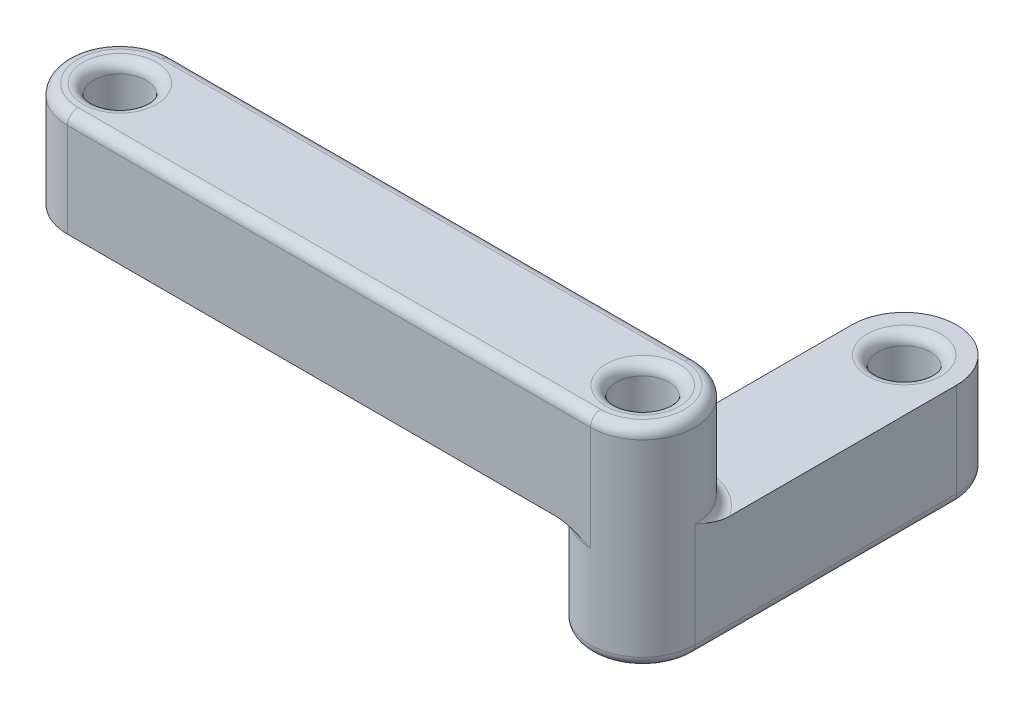
ISO-10303-21;
HEADER;
FILE_DESCRIPTION(('STEP AP214'),'2;1');
FILE_NAME('part.step','',(''),(''),'','','');
FILE_SCHEMA(('AUTOMOTIVE_DESIGN { 1 0 10303 214 1 1 1 1 }'));
ENDSEC;
DATA;
#1=APPLICATION_CONTEXT('core data for automotive mechanical design processes');
#2=APPLICATION_PROTOCOL_DEFINITION('international standard','automotive_design',2000,#1);
#3=PRODUCT_CONTEXT('',#1,'mechanical');
#4=PRODUCT('Part','Part','',(#3));
#5=PRODUCT_RELATED_PRODUCT_CATEGORY('part','',(#4));
#6=PRODUCT_DEFINITION_FORMATION('','',#4);
#7=PRODUCT_DEFINITION_CONTEXT('part definition',#1,'design');
#8=PRODUCT_DEFINITION('design','',#6,#7);
#9=PRODUCT_DEFINITION_SHAPE('','',#8);
#10=(LENGTH_UNIT() NAMED_UNIT(*) SI_UNIT(.MILLI.,.METRE.));
#11=(NAMED_UNIT(*) PLANE_ANGLE_UNIT() SI_UNIT($,.RADIAN.));
#12=(NAMED_UNIT(*) SI_UNIT($,.STERADIAN.) SOLID_ANGLE_UNIT());
#13=UNCERTAINTY_MEASURE_WITH_UNIT(LENGTH_MEASURE(1.E-05),#10,'distance_accuracy_value','');
#14=(GEOMETRIC_REPRESENTATION_CONTEXT(3) GLOBAL_UNCERTAINTY_ASSIGNED_CONTEXT((#13)) GLOBAL_UNIT_ASSIGNED_CONTEXT((#10,
#11,#12)) REPRESENTATION_CONTEXT('',''));
#15=CARTESIAN_POINT('',(0.,0.,0.));
#16=DIRECTION('',(0.,0.,1.));
#17=DIRECTION('',(1.,0.,0.));
#18=AXIS2_PLACEMENT_3D('',#15,#16,#17);
#19=CARTESIAN_POINT('',(0.,10.,0.));
#20=DIRECTION('',(0.,-1.,0.));
#21=DIRECTION('',(0.,0.,-1.));
#22=AXIS2_PLACEMENT_3D('',#19,#20,#21);
#23=CYLINDRICAL_SURFACE('',#22,5.);
#24=DIRECTION('',(0.,-1.,0.));
#25=VECTOR('',#24,1.);
#26=CARTESIAN_POINT('',(0.,10.,5.));
#27=LINE('',#26,#25);
#28=CARTESIAN_POINT('',(0.,-0.999999999999999,5.));
#29=VERTEX_POINT('',#28);
#30=CARTESIAN_POINT('',(0.,-10.,5.));
#31=VERTEX_POINT('',#30);
#32=EDGE_CURVE('E222',#29,#31,#27,.T.);
#33=ORIENTED_EDGE('',*,*,#32,.F.);
#34=CARTESIAN_POINT('',(0.,-0.999999999999999,0.));
#35=DIRECTION('',(0.,-1.,0.));
#36=DIRECTION('',(0.,0.,-1.));
#37=AXIS2_PLACEMENT_3D('',#34,#35,#36);
#38=CIRCLE('',#37,5.);
#39=CARTESIAN_POINT('',(0.,-0.999999999999999,-5.));
#40=VERTEX_POINT('',#39);
#41=EDGE_CURVE('E272',#29,#40,#38,.T.);
#42=ORIENTED_EDGE('',*,*,#41,.T.);
#43=DIRECTION('',(0.,-1.,0.));
#44=VECTOR('',#43,1.);
#45=CARTESIAN_POINT('',(0.,10.,-5.));
#46=LINE('',#45,#44);
#47=CARTESIAN_POINT('',(0.,-10.,-5.));
#48=VERTEX_POINT('',#47);
#49=EDGE_CURVE('E212',#40,#48,#46,.T.);
#50=ORIENTED_EDGE('',*,*,#49,.T.);
#51=CARTESIAN_POINT('',(0.,-10.,0.));
#52=DIRECTION('',(0.,1.,0.));
#53=DIRECTION('',(0.,0.,1.));
#54=AXIS2_PLACEMENT_3D('',#51,#52,#53);
#55=CIRCLE('',#54,5.);
#56=EDGE_CURVE('E201',#48,#31,#55,.T.);
#57=ORIENTED_EDGE('',*,*,#56,.T.);
#58=EDGE_LOOP('',(#33,#42,#50,#57));
#59=FACE_BOUND('',#58,.T.);
#60=ADVANCED_FACE('F40',(#59),#23,.T.);
#61=CARTESIAN_POINT('',(0.,10.,5.));
#62=DIRECTION('',(0.,0.,-1.));
#63=DIRECTION('',(-1.,0.,0.));
#64=AXIS2_PLACEMENT_3D('',#61,#62,#63);
#65=PLANE('',#64);
#66=DIRECTION('',(0.,-1.,0.));
#67=VECTOR('',#66,1.);
#68=CARTESIAN_POINT('',(50.,10.,5.));
#69=LINE('',#68,#67);
#70=CARTESIAN_POINT('',(50.,-0.999999999999999,5.));
#71=VERTEX_POINT('',#70);
#72=CARTESIAN_POINT('',(50.,-11.,5.));
#73=VERTEX_POINT('',#72);
#74=EDGE_CURVE('E64',#71,#73,#69,.T.);
#75=ORIENTED_EDGE('',*,*,#74,.F.);
#76=DIRECTION('',(1.,0.,0.));
#77=VECTOR('',#76,1.);
#78=CARTESIAN_POINT('',(0.,-0.999999999999999,5.));
#79=LINE('',#78,#77);
#80=EDGE_CURVE('E300',#71,#29,#79,.F.);
#81=ORIENTED_EDGE('',*,*,#80,.T.);
#82=ORIENTED_EDGE('',*,*,#32,.T.);
#83=DIRECTION('',(1.,0.,0.));
#84=VECTOR('',#83,1.);
#85=CARTESIAN_POINT('',(0.,-10.,5.));
#86=LINE('',#85,#84);
#87=CARTESIAN_POINT('',(46.6833752096446,-10.,5.));
#88=VERTEX_POINT('',#87);
#89=EDGE_CURVE('E205',#31,#88,#86,.T.);
#90=ORIENTED_EDGE('',*,*,#89,.T.);
#91=CARTESIAN_POINT('',(46.6833752096446,-10.,5.));
#92=CARTESIAN_POINT('',(46.7450551738098,-10.0000073448778,5.));
#93=CARTESIAN_POINT('',(46.8067103718721,-10.0017426295204,5.));
#94=CARTESIAN_POINT('',(46.9298215233883,-10.0083207227693,5.));
#95=CARTESIAN_POINT('',(46.9912775721782,-10.0131617158651,5.));
#96=CARTESIAN_POINT('',(47.1748668693675,-10.0317877579638,5.));
#97=CARTESIAN_POINT('',(47.2965884298721,-10.0496800784524,5.));
#98=CARTESIAN_POINT('',(47.5370271158474,-10.0939613378526,5.));
#99=CARTESIAN_POINT('',(47.6557625493275,-10.1202549836714,5.));
#100=CARTESIAN_POINT('',(47.8915853821564,-10.1796974773276,5.));
#101=CARTESIAN_POINT('',(48.0086713204055,-10.212852039063,5.));
#102=CARTESIAN_POINT('',(48.284488759011,-10.2979248994134,5.));
#103=CARTESIAN_POINT('',(48.4424761581158,-10.3522308971437,5.));
#104=CARTESIAN_POINT('',(48.7558444952943,-10.4679560521697,5.));
#105=CARTESIAN_POINT('',(48.9112243029456,-10.5293782076369,5.));
#106=CARTESIAN_POINT('',(49.3753699632936,-10.7207361591975,5.));
#107=CARTESIAN_POINT('',(49.6812841793298,-10.8574670446341,5.));
#108=CARTESIAN_POINT('',(49.9913933812025,-10.9961510169498,5.));
#109=CARTESIAN_POINT('',(49.9956966961922,-10.9980755182051,5.));
#110=CARTESIAN_POINT('',(50.,-11.,5.));
#111=B_SPLINE_CURVE_WITH_KNOTS('',3,(#91,#92,#93,#94,#95,#96,#97,#98,#99,#100,#101,#102,#103,
#104,#105,#106,#107,#108,#109,#110),.UNSPECIFIED.,.F.,.F.,(4,2,2,2,2,2,2,2,2,4),(0.,
0.184977192336631,0.369846350577189,0.738487583098506,1.1030876409045,1.46799257532018,
1.96890994139299,2.47003912618646,3.47501470229637,3.48915683792113),.UNSPECIFIED.);
#112=EDGE_CURVE('E381',#88,#73,#111,.T.);
#113=ORIENTED_EDGE('',*,*,#112,.T.);
#114=EDGE_LOOP('',(#75,#81,#82,#90,#113));
#115=FACE_BOUND('',#114,.T.);
#116=ADVANCED_FACE('F394',(#115),#65,.F.);
#117=CARTESIAN_POINT('',(50.,10.,0.));
#118=DIRECTION('',(0.,-1.,0.));
#119=DIRECTION('',(0.,0.,-1.));
#120=AXIS2_PLACEMENT_3D('',#117,#118,#119);
#121=CYLINDRICAL_SURFACE('',#120,5.);
#122=ORIENTED_EDGE('',*,*,#74,.T.);
#123=CARTESIAN_POINT('',(50.,-11.,0.));
#124=DIRECTION('',(0.,-1.,0.));
#125=DIRECTION('',(0.,0.,-1.));
#126=AXIS2_PLACEMENT_3D('',#123,#124,#125);
#127=CIRCLE('',#126,5.);
#128=CARTESIAN_POINT('',(45.,-11.,0.));
#129=VERTEX_POINT('',#128);
#130=EDGE_CURVE('E587',#73,#129,#127,.T.);
#131=ORIENTED_EDGE('',*,*,#130,.T.);
#132=DIRECTION('',(0.,1.,0.));
#133=VECTOR('',#132,1.);
#134=CARTESIAN_POINT('',(45.,-20.,0.));
#135=LINE('',#134,#133);
#136=CARTESIAN_POINT('',(45.,-19.,0.));
#137=VERTEX_POINT('',#136);
#138=EDGE_CURVE('E187',#137,#129,#135,.T.);
#139=ORIENTED_EDGE('',*,*,#138,.F.);
#140=CARTESIAN_POINT('',(50.,-19.,0.));
#141=DIRECTION('',(0.,-1.,0.));
#142=DIRECTION('',(0.,0.,-1.));
#143=AXIS2_PLACEMENT_3D('',#140,#141,#142);
#144=CIRCLE('',#143,5.);
#145=CARTESIAN_POINT('',(55.,-19.,0.));
#146=VERTEX_POINT('',#145);
#147=EDGE_CURVE('E261',#137,#146,#144,.F.);
#148=ORIENTED_EDGE('',*,*,#147,.T.);
#149=DIRECTION('',(0.,1.,0.));
#150=VECTOR('',#149,1.);
#151=CARTESIAN_POINT('',(55.,-20.,0.));
#152=LINE('',#151,#150);
#153=CARTESIAN_POINT('',(55.,-9.,0.));
#154=VERTEX_POINT('',#153);
#155=EDGE_CURVE('E177',#146,#154,#152,.T.);
#156=ORIENTED_EDGE('',*,*,#155,.T.);
#157=CARTESIAN_POINT('',(50.,-9.,0.));
#158=DIRECTION('',(0.,-1.,0.));
#159=DIRECTION('',(0.,0.,-1.));
#160=AXIS2_PLACEMENT_3D('',#157,#158,#159);
#161=CIRCLE('',#160,5.);
#162=CARTESIAN_POINT('',(50.,-9.,-5.));
#163=VERTEX_POINT('',#162);
#164=EDGE_CURVE('E307',#154,#163,#161,.F.);
#165=ORIENTED_EDGE('',*,*,#164,.T.);
#166=DIRECTION('',(0.,-1.,0.));
#167=VECTOR('',#166,1.);
#168=CARTESIAN_POINT('',(50.,10.,-5.));
#169=LINE('',#168,#167);
#170=CARTESIAN_POINT('',(50.,-0.999999999999999,-5.));
#171=VERTEX_POINT('',#170);
#172=EDGE_CURVE('E216',#171,#163,#169,.T.);
#173=ORIENTED_EDGE('',*,*,#172,.F.);
#174=CARTESIAN_POINT('',(50.,-0.999999999999999,0.));
#175=DIRECTION('',(0.,-1.,0.));
#176=DIRECTION('',(0.,0.,-1.));
#177=AXIS2_PLACEMENT_3D('',#174,#175,#176);
#178=CIRCLE('',#177,5.);
#179=EDGE_CURVE('E258',#171,#71,#178,.T.);
#180=ORIENTED_EDGE('',*,*,#179,.T.);
#181=EDGE_LOOP('',(#122,#131,#139,#148,#156,#165,#173,#180));
#182=FACE_BOUND('',#181,.T.);
#183=ADVANCED_FACE('F399',(#182),#121,.T.);
#184=CARTESIAN_POINT('',(0.,10.,-5.));
#185=DIRECTION('',(0.,0.,1.));
#186=DIRECTION('',(1.,0.,0.));
#187=AXIS2_PLACEMENT_3D('',#184,#185,#186);
#188=PLANE('',#187);
#189=ORIENTED_EDGE('',*,*,#172,.T.);
#190=DIRECTION('',(-1.,0.,0.));
#191=VECTOR('',#190,1.);
#192=CARTESIAN_POINT('',(45.,-9.,-5.));
#193=LINE('',#192,#191);
#194=CARTESIAN_POINT('',(45.,-9.,-5.));
#195=VERTEX_POINT('',#194);
#196=EDGE_CURVE('E346',#163,#195,#193,.T.);
#197=ORIENTED_EDGE('',*,*,#196,.T.);
#198=DIRECTION('',(0.,-1.,0.));
#199=VECTOR('',#198,1.);
#200=CARTESIAN_POINT('',(45.,-20.,-5.));
#201=LINE('',#200,#199);
#202=CARTESIAN_POINT('',(45.,-11.,-5.));
#203=VERTEX_POINT('',#202);
#204=EDGE_CURVE('E56',#195,#203,#201,.T.);
#205=ORIENTED_EDGE('',*,*,#204,.T.);
#206=CARTESIAN_POINT('',(44.,-11.,-5.));
#207=DIRECTION('',(0.,0.,1.));
#208=DIRECTION('',(1.,0.,0.));
#209=AXIS2_PLACEMENT_3D('',#206,#207,#208);
#210=CIRCLE('',#209,1.);
#211=CARTESIAN_POINT('',(44.,-10.,-5.));
#212=VERTEX_POINT('',#211);
#213=EDGE_CURVE('E390',#203,#212,#210,.T.);
#214=ORIENTED_EDGE('',*,*,#213,.T.);
#215=DIRECTION('',(-1.,0.,0.));
#216=VECTOR('',#215,1.);
#217=CARTESIAN_POINT('',(0.,-10.,-5.));
#218=LINE('',#217,#216);
#219=EDGE_CURVE('E209',#212,#48,#218,.T.);
#220=ORIENTED_EDGE('',*,*,#219,.T.);
#221=ORIENTED_EDGE('',*,*,#49,.F.);
#222=DIRECTION('',(1.,0.,0.));
#223=VECTOR('',#222,1.);
#224=CARTESIAN_POINT('',(0.,-0.999999999999999,-5.));
#225=LINE('',#224,#223);
#226=EDGE_CURVE('E297',#40,#171,#225,.T.);
#227=ORIENTED_EDGE('',*,*,#226,.T.);
#228=EDGE_LOOP('',(#189,#197,#205,#214,#220,#221,#227));
#229=FACE_BOUND('',#228,.T.);
#230=ADVANCED_FACE('F515',(#229),#188,.F.);
#231=CARTESIAN_POINT('',(0.,10.,0.));
#232=DIRECTION('',(0.,-1.,0.));
#233=DIRECTION('',(0.,0.,-1.));
#234=AXIS2_PLACEMENT_3D('',#231,#232,#233);
#235=CYLINDRICAL_SURFACE('',#234,2.5);
#236=CARTESIAN_POINT('',(0.,-0.999999999999999,0.));
#237=DIRECTION('',(0.,-1.,0.));
#238=DIRECTION('',(0.,0.,-1.));
#239=AXIS2_PLACEMENT_3D('',#236,#237,#238);
#240=CIRCLE('',#239,2.5);
#241=CARTESIAN_POINT('',(0.,-0.999999999999999,-2.5));
#242=VERTEX_POINT('',#241);
#243=EDGE_CURVE('E303',#242,#242,#240,.F.);
#244=ORIENTED_EDGE('',*,*,#243,.T.);
#245=EDGE_LOOP('',(#244));
#246=FACE_BOUND('',#245,.T.);
#247=CARTESIAN_POINT('',(0.,-10.,0.));
#248=DIRECTION('',(0.,1.,0.));
#249=DIRECTION('',(0.,0.,1.));
#250=AXIS2_PLACEMENT_3D('',#247,#248,#249);
#251=CIRCLE('',#250,2.5);
#252=CARTESIAN_POINT('',(0.,-10.,2.5));
#253=VERTEX_POINT('',#252);
#254=EDGE_CURVE('E197',#253,#253,#251,.T.);
#255=ORIENTED_EDGE('',*,*,#254,.F.);
#256=EDGE_LOOP('',(#255));
#257=FACE_BOUND('',#256,.T.);
#258=ADVANCED_FACE('F521',(#246,#257),#235,.F.);
#259=CARTESIAN_POINT('',(50.,10.,0.));
#260=DIRECTION('',(0.,-1.,0.));
#261=DIRECTION('',(0.,0.,-1.));
#262=AXIS2_PLACEMENT_3D('',#259,#260,#261);
#263=CYLINDRICAL_SURFACE('',#262,2.5);
#264=CARTESIAN_POINT('',(50.,-19.,0.));
#265=DIRECTION('',(0.,-1.,0.));
#266=DIRECTION('',(0.,0.,-1.));
#267=AXIS2_PLACEMENT_3D('',#264,#265,#266);
#268=CIRCLE('',#267,2.5);
#269=CARTESIAN_POINT('',(50.,-19.,-2.5));
#270=VERTEX_POINT('',#269);
#271=EDGE_CURVE('E268',#270,#270,#268,.T.);
#272=ORIENTED_EDGE('',*,*,#271,.T.);
#273=EDGE_LOOP('',(#272));
#274=FACE_BOUND('',#273,.T.);
#275=CARTESIAN_POINT('',(50.,-0.999999999999999,0.));
#276=DIRECTION('',(0.,-1.,0.));
#277=DIRECTION('',(0.,0.,-1.));
#278=AXIS2_PLACEMENT_3D('',#275,#276,#277);
#279=CIRCLE('',#278,2.5);
#280=CARTESIAN_POINT('',(50.,-0.999999999999999,-2.5));
#281=VERTEX_POINT('',#280);
#282=EDGE_CURVE('E264',#281,#281,#279,.F.);
#283=ORIENTED_EDGE('',*,*,#282,.T.);
#284=EDGE_LOOP('',(#283));
#285=FACE_BOUND('',#284,.T.);
#286=ADVANCED_FACE('F528',(#274,#285),#263,.F.);
#287=CARTESIAN_POINT('',(0.,-10.,0.));
#288=DIRECTION('',(0.,-1.,0.));
#289=DIRECTION('',(0.,0.,1.));
#290=AXIS2_PLACEMENT_3D('',#287,#288,#289);
#291=PLANE('',#290);
#292=DIRECTION('',(0.,0.,1.));
#293=VECTOR('',#292,1.);
#294=CARTESIAN_POINT('',(44.,-10.,0.));
#295=LINE('',#294,#293);
#296=CARTESIAN_POINT('',(44.,-10.,0.));
#297=VERTEX_POINT('',#296);
#298=EDGE_CURVE('E581',#212,#297,#295,.T.);
#299=ORIENTED_EDGE('',*,*,#298,.T.);
#300=CARTESIAN_POINT('',(50.,-10.,0.));
#301=DIRECTION('',(0.,-1.,0.));
#302=DIRECTION('',(0.,0.,-1.));
#303=AXIS2_PLACEMENT_3D('',#300,#301,#302);
#304=CIRCLE('',#303,6.);
#305=EDGE_CURVE('E584',#297,#88,#304,.F.);
#306=ORIENTED_EDGE('',*,*,#305,.T.);
#307=ORIENTED_EDGE('',*,*,#89,.F.);
#308=ORIENTED_EDGE('',*,*,#56,.F.);
#309=ORIENTED_EDGE('',*,*,#219,.F.);
#310=EDGE_LOOP('',(#299,#306,#307,#308,#309));
#311=FACE_BOUND('',#310,.T.);
#312=ORIENTED_EDGE('',*,*,#254,.T.);
#313=EDGE_LOOP('',(#312));
#314=FACE_BOUND('',#313,.T.);
#315=ADVANCED_FACE('F477',(#311,#314),#291,.T.);
#316=CARTESIAN_POINT('',(50.,-10.,0.));
#317=DIRECTION('',(0.,-1.,0.));
#318=DIRECTION('',(0.,0.,1.));
#319=AXIS2_PLACEMENT_3D('',#316,#317,#318);
#320=PLANE('',#319);
#321=CARTESIAN_POINT('',(50.,-10.,-25.));
#322=DIRECTION('',(0.,-1.,0.));
#323=DIRECTION('',(0.,0.,-1.));
#324=AXIS2_PLACEMENT_3D('',#321,#322,#323);
#325=CIRCLE('',#324,3.5);
#326=CARTESIAN_POINT('',(50.,-10.,-28.5));
#327=VERTEX_POINT('',#326);
#328=EDGE_CURVE('E11',#327,#327,#325,.T.);
#329=ORIENTED_EDGE('',*,*,#328,.T.);
#330=EDGE_LOOP('',(#329));
#331=FACE_BOUND('',#330,.T.);
#332=DIRECTION('',(-1.,0.,0.));
#333=VECTOR('',#332,1.);
#334=CARTESIAN_POINT('',(50.,-10.,-6.));
#335=LINE('',#334,#333);
#336=CARTESIAN_POINT('',(45.,-10.,-6.));
#337=VERTEX_POINT('',#336);
#338=CARTESIAN_POINT('',(50.,-10.,-6.));
#339=VERTEX_POINT('',#338);
#340=EDGE_CURVE('E339',#337,#339,#335,.F.);
#341=ORIENTED_EDGE('',*,*,#340,.T.);
#342=CARTESIAN_POINT('',(50.,-10.,0.));
#343=DIRECTION('',(0.,-1.,0.));
#344=DIRECTION('',(0.,0.,-1.));
#345=AXIS2_PLACEMENT_3D('',#342,#343,#344);
#346=CIRCLE('',#345,6.);
#347=CARTESIAN_POINT('',(55.,-10.,-3.3166247903554));
#348=VERTEX_POINT('',#347);
#349=EDGE_CURVE('E161',#339,#348,#346,.T.);
#350=ORIENTED_EDGE('',*,*,#349,.T.);
#351=DIRECTION('',(0.,0.,-1.));
#352=VECTOR('',#351,1.);
#353=CARTESIAN_POINT('',(55.,-10.,0.));
#354=LINE('',#353,#352);
#355=CARTESIAN_POINT('',(55.,-10.,-25.));
#356=VERTEX_POINT('',#355);
#357=EDGE_CURVE('E154',#348,#356,#354,.T.);
#358=ORIENTED_EDGE('',*,*,#357,.T.);
#359=CARTESIAN_POINT('',(50.,-10.,-25.));
#360=DIRECTION('',(0.,1.,0.));
#361=DIRECTION('',(0.,0.,1.));
#362=AXIS2_PLACEMENT_3D('',#359,#360,#361);
#363=CIRCLE('',#362,5.);
#364=CARTESIAN_POINT('',(45.,-10.,-25.));
#365=VERTEX_POINT('',#364);
#366=EDGE_CURVE('E159',#356,#365,#363,.T.);
#367=ORIENTED_EDGE('',*,*,#366,.T.);
#368=DIRECTION('',(0.,0.,1.));
#369=VECTOR('',#368,1.);
#370=CARTESIAN_POINT('',(45.,-10.,0.));
#371=LINE('',#370,#369);
#372=EDGE_CURVE('E184',#365,#337,#371,.T.);
#373=ORIENTED_EDGE('',*,*,#372,.T.);
#374=EDGE_LOOP('',(#341,#350,#358,#367,#373));
#375=FACE_BOUND('',#374,.T.);
#376=ADVANCED_FACE('F156',(#331,#375),#320,.F.);
#377=CARTESIAN_POINT('',(50.,-20.,0.));
#378=DIRECTION('',(0.,-1.,0.));
#379=DIRECTION('',(0.,0.,1.));
#380=AXIS2_PLACEMENT_3D('',#377,#378,#379);
#381=PLANE('',#380);
#382=CARTESIAN_POINT('',(50.,-20.,-25.));
#383=DIRECTION('',(0.,-1.,0.));
#384=DIRECTION('',(0.,0.,-1.));
#385=AXIS2_PLACEMENT_3D('',#382,#383,#384);
#386=CIRCLE('',#385,3.5);
#387=CARTESIAN_POINT('',(50.,-20.,-28.5));
#388=VERTEX_POINT('',#387);
#389=EDGE_CURVE('E242',#388,#388,#386,.F.);
#390=ORIENTED_EDGE('',*,*,#389,.T.);
#391=EDGE_LOOP('',(#390));
#392=FACE_BOUND('',#391,.T.);
#393=CARTESIAN_POINT('',(50.,-20.,-25.));
#394=DIRECTION('',(0.,-1.,0.));
#395=DIRECTION('',(0.,0.,-1.));
#396=AXIS2_PLACEMENT_3D('',#393,#394,#395);
#397=CIRCLE('',#396,4.);
#398=CARTESIAN_POINT('',(46.,-20.,-25.));
#399=VERTEX_POINT('',#398);
#400=CARTESIAN_POINT('',(54.,-20.,-25.));
#401=VERTEX_POINT('',#400);
#402=EDGE_CURVE('E235',#399,#401,#397,.T.);
#403=ORIENTED_EDGE('',*,*,#402,.T.);
#404=DIRECTION('',(0.,0.,-1.));
#405=VECTOR('',#404,1.);
#406=CARTESIAN_POINT('',(54.,-20.,0.));
#407=LINE('',#406,#405);
#408=CARTESIAN_POINT('',(54.,-20.,0.));
#409=VERTEX_POINT('',#408);
#410=EDGE_CURVE('E238',#401,#409,#407,.F.);
#411=ORIENTED_EDGE('',*,*,#410,.T.);
#412=CARTESIAN_POINT('',(50.,-20.,0.));
#413=DIRECTION('',(0.,-1.,0.));
#414=DIRECTION('',(0.,0.,-1.));
#415=AXIS2_PLACEMENT_3D('',#412,#413,#414);
#416=CIRCLE('',#415,4.);
#417=CARTESIAN_POINT('',(46.,-20.,0.));
#418=VERTEX_POINT('',#417);
#419=EDGE_CURVE('E229',#409,#418,#416,.T.);
#420=ORIENTED_EDGE('',*,*,#419,.T.);
#421=DIRECTION('',(0.,0.,1.));
#422=VECTOR('',#421,1.);
#423=CARTESIAN_POINT('',(46.,-20.,-25.));
#424=LINE('',#423,#422);
#425=EDGE_CURVE('E232',#418,#399,#424,.F.);
#426=ORIENTED_EDGE('',*,*,#425,.T.);
#427=EDGE_LOOP('',(#403,#411,#420,#426));
#428=FACE_BOUND('',#427,.T.);
#429=CARTESIAN_POINT('',(50.,-20.,0.));
#430=DIRECTION('',(0.,-1.,0.));
#431=DIRECTION('',(0.,0.,-1.));
#432=AXIS2_PLACEMENT_3D('',#429,#430,#431);
#433=CIRCLE('',#432,3.5);
#434=CARTESIAN_POINT('',(50.,-20.,-3.5));
#435=VERTEX_POINT('',#434);
#436=EDGE_CURVE('E225',#435,#435,#433,.F.);
#437=ORIENTED_EDGE('',*,*,#436,.T.);
#438=EDGE_LOOP('',(#437));
#439=FACE_BOUND('',#438,.T.);
#440=ADVANCED_FACE('F471',(#392,#428,#439),#381,.T.);
#441=CARTESIAN_POINT('',(55.,-20.,0.));
#442=DIRECTION('',(-1.,0.,0.));
#443=DIRECTION('',(0.,0.,1.));
#444=AXIS2_PLACEMENT_3D('',#441,#442,#443);
#445=PLANE('',#444);
#446=ORIENTED_EDGE('',*,*,#155,.F.);
#447=DIRECTION('',(0.,0.,-1.));
#448=VECTOR('',#447,1.);
#449=CARTESIAN_POINT('',(55.,-19.,-25.));
#450=LINE('',#449,#448);
#451=CARTESIAN_POINT('',(55.,-19.,-25.));
#452=VERTEX_POINT('',#451);
#453=EDGE_CURVE('E174',#146,#452,#450,.T.);
#454=ORIENTED_EDGE('',*,*,#453,.T.);
#455=DIRECTION('',(0.,1.,0.));
#456=VECTOR('',#455,1.);
#457=CARTESIAN_POINT('',(55.,-20.,-25.));
#458=LINE('',#457,#456);
#459=EDGE_CURVE('E170',#452,#356,#458,.T.);
#460=ORIENTED_EDGE('',*,*,#459,.T.);
#461=ORIENTED_EDGE('',*,*,#357,.F.);
#462=CARTESIAN_POINT('',(55.,-10.,-3.3166247903554));
#463=CARTESIAN_POINT('',(55.,-9.99999265512221,-3.25494482619008));
#464=CARTESIAN_POINT('',(55.,-9.99825737047963,-3.19328962812761));
#465=CARTESIAN_POINT('',(55.,-9.99167927723069,-3.07017847661111));
#466=CARTESIAN_POINT('',(55.,-9.9868382841348,-3.00872242782101));
#467=CARTESIAN_POINT('',(55.,-9.96821224203602,-2.82513313063131));
#468=CARTESIAN_POINT('',(55.,-9.95031992154743,-2.70341157012645));
#469=CARTESIAN_POINT('',(55.,-9.90603866214711,-2.46297288415124));
#470=CARTESIAN_POINT('',(55.,-9.87974501632837,-2.34423745067143));
#471=CARTESIAN_POINT('',(55.,-9.82030252267229,-2.10841461784311));
#472=CARTESIAN_POINT('',(55.,-9.78714796093694,-1.99132867959425));
#473=CARTESIAN_POINT('',(55.,-9.70207510058658,-1.71551124098912));
#474=CARTESIAN_POINT('',(55.,-9.64776910285604,-1.55752384188437));
#475=CARTESIAN_POINT('',(55.,-9.53204394783059,-1.24415550470578));
#476=CARTESIAN_POINT('',(55.,-9.47062179236419,-1.08877569705426));
#477=CARTESIAN_POINT('',(55.,-9.27926384080067,-0.624630036707562));
#478=CARTESIAN_POINT('',(55.,-9.14253295535513,-0.318715820675118));
#479=CARTESIAN_POINT('',(55.,-9.00384898304987,-0.00860661879758961));
#480=CARTESIAN_POINT('',(55.,-9.00192448179476,-0.00430330380789881));
#481=CARTESIAN_POINT('',(55.,-9.,0.));
#482=B_SPLINE_CURVE_WITH_KNOTS('',3,(#462,#463,#464,#465,#466,#467,#468,#469,#470,#471,#472,
#473,#474,#475,#476,#477,#478,#479,#480,#481),.UNSPECIFIED.,.F.,.F.,(4,2,2,2,2,2,2,2,2,4),(0.,
0.18497719233711,0.369846350578148,0.738487583100217,1.1030876409053,1.46799257532017,
1.96890994139287,2.47003912618606,3.47501470229638,3.48915683792113),.UNSPECIFIED.);
#483=EDGE_CURVE('E349',#348,#154,#482,.T.);
#484=ORIENTED_EDGE('',*,*,#483,.T.);
#485=EDGE_LOOP('',(#446,#454,#460,#461,#484));
#486=FACE_BOUND('',#485,.T.);
#487=ADVANCED_FACE('F172',(#486),#445,.F.);
#488=CARTESIAN_POINT('',(50.,-20.,-25.));
#489=DIRECTION('',(0.,1.,0.));
#490=DIRECTION('',(0.,0.,-1.));
#491=AXIS2_PLACEMENT_3D('',#488,#489,#490);
#492=CYLINDRICAL_SURFACE('',#491,5.);
#493=ORIENTED_EDGE('',*,*,#459,.F.);
#494=CARTESIAN_POINT('',(50.,-19.,-25.));
#495=DIRECTION('',(0.,-1.,0.));
#496=DIRECTION('',(0.,0.,-1.));
#497=AXIS2_PLACEMENT_3D('',#494,#495,#496);
#498=CIRCLE('',#497,5.);
#499=CARTESIAN_POINT('',(45.,-19.,-25.));
#500=VERTEX_POINT('',#499);
#501=EDGE_CURVE('E252',#452,#500,#498,.F.);
#502=ORIENTED_EDGE('',*,*,#501,.T.);
#503=DIRECTION('',(0.,1.,0.));
#504=VECTOR('',#503,1.);
#505=CARTESIAN_POINT('',(45.,-20.,-25.));
#506=LINE('',#505,#504);
#507=EDGE_CURVE('E178',#500,#365,#506,.T.);
#508=ORIENTED_EDGE('',*,*,#507,.T.);
#509=ORIENTED_EDGE('',*,*,#366,.F.);
#510=EDGE_LOOP('',(#493,#502,#508,#509));
#511=FACE_BOUND('',#510,.T.);
#512=ADVANCED_FACE('F180',(#511),#492,.T.);
#513=CARTESIAN_POINT('',(45.,-20.,0.));
#514=DIRECTION('',(1.,0.,0.));
#515=DIRECTION('',(0.,0.,-1.));
#516=AXIS2_PLACEMENT_3D('',#513,#514,#515);
#517=PLANE('',#516);
#518=ORIENTED_EDGE('',*,*,#138,.T.);
#519=DIRECTION('',(0.,0.,1.));
#520=VECTOR('',#519,1.);
#521=CARTESIAN_POINT('',(45.,-11.,0.));
#522=LINE('',#521,#520);
#523=EDGE_CURVE('E391',#129,#203,#522,.F.);
#524=ORIENTED_EDGE('',*,*,#523,.T.);
#525=ORIENTED_EDGE('',*,*,#204,.F.);
#526=CARTESIAN_POINT('',(45.,-9.,-6.));
#527=DIRECTION('',(1.,0.,0.));
#528=DIRECTION('',(0.,0.,-1.));
#529=AXIS2_PLACEMENT_3D('',#526,#527,#528);
#530=CIRCLE('',#529,1.);
#531=EDGE_CURVE('E358',#195,#337,#530,.T.);
#532=ORIENTED_EDGE('',*,*,#531,.T.);
#533=ORIENTED_EDGE('',*,*,#372,.F.);
#534=ORIENTED_EDGE('',*,*,#507,.F.);
#535=DIRECTION('',(0.,0.,1.));
#536=VECTOR('',#535,1.);
#537=CARTESIAN_POINT('',(45.,-19.,0.));
#538=LINE('',#537,#536);
#539=EDGE_CURVE('E255',#500,#137,#538,.T.);
#540=ORIENTED_EDGE('',*,*,#539,.T.);
#541=EDGE_LOOP('',(#518,#524,#525,#532,#533,#534,#540));
#542=FACE_BOUND('',#541,.T.);
#543=ADVANCED_FACE('F467',(#542),#517,.F.);
#544=CARTESIAN_POINT('',(50.,-20.,-25.));
#545=DIRECTION('',(0.,1.,0.));
#546=DIRECTION('',(0.,0.,-1.));
#547=AXIS2_PLACEMENT_3D('',#544,#545,#546);
#548=CYLINDRICAL_SURFACE('',#547,2.5);
#549=CARTESIAN_POINT('',(50.,-11.,-25.));
#550=DIRECTION('',(0.,-1.,0.));
#551=DIRECTION('',(0.,0.,-1.));
#552=AXIS2_PLACEMENT_3D('',#549,#550,#551);
#553=CIRCLE('',#552,2.5);
#554=CARTESIAN_POINT('',(50.,-11.,-27.5));
#555=VERTEX_POINT('',#554);
#556=EDGE_CURVE('E49',#555,#555,#553,.F.);
#557=ORIENTED_EDGE('',*,*,#556,.T.);
#558=EDGE_LOOP('',(#557));
#559=FACE_BOUND('',#558,.T.);
#560=CARTESIAN_POINT('',(50.,-19.,-25.));
#561=DIRECTION('',(0.,-1.,0.));
#562=DIRECTION('',(0.,0.,-1.));
#563=AXIS2_PLACEMENT_3D('',#560,#561,#562);
#564=CIRCLE('',#563,2.5);
#565=CARTESIAN_POINT('',(50.,-19.,-27.5));
#566=VERTEX_POINT('',#565);
#567=EDGE_CURVE('E246',#566,#566,#564,.T.);
#568=ORIENTED_EDGE('',*,*,#567,.T.);
#569=EDGE_LOOP('',(#568));
#570=FACE_BOUND('',#569,.T.);
#571=ADVANCED_FACE('F458',(#559,#570),#548,.F.);
#572=CARTESIAN_POINT('',(-5.,0.,5.));
#573=DIRECTION('',(0.,-1.,0.));
#574=DIRECTION('',(0.,0.,-1.));
#575=AXIS2_PLACEMENT_3D('',#572,#573,#574);
#576=PLANE('',#575);
#577=DIRECTION('',(1.,0.,0.));
#578=VECTOR('',#577,1.);
#579=CARTESIAN_POINT('',(-5.,0.,-4.));
#580=LINE('',#579,#578);
#581=CARTESIAN_POINT('',(50.,0.,-4.));
#582=VERTEX_POINT('',#581);
#583=CARTESIAN_POINT('',(0.,0.,-4.));
#584=VERTEX_POINT('',#583);
#585=EDGE_CURVE('E290',#582,#584,#580,.F.);
#586=ORIENTED_EDGE('',*,*,#585,.T.);
#587=CARTESIAN_POINT('',(0.,0.,0.));
#588=DIRECTION('',(0.,-1.,0.));
#589=DIRECTION('',(0.,0.,-1.));
#590=AXIS2_PLACEMENT_3D('',#587,#588,#589);
#591=CIRCLE('',#590,4.);
#592=CARTESIAN_POINT('',(0.,0.,4.));
#593=VERTEX_POINT('',#592);
#594=EDGE_CURVE('E293',#584,#593,#591,.F.);
#595=ORIENTED_EDGE('',*,*,#594,.T.);
#596=DIRECTION('',(1.,0.,0.));
#597=VECTOR('',#596,1.);
#598=CARTESIAN_POINT('',(-5.,0.,4.));
#599=LINE('',#598,#597);
#600=CARTESIAN_POINT('',(50.,0.,4.));
#601=VERTEX_POINT('',#600);
#602=EDGE_CURVE('E284',#593,#601,#599,.T.);
#603=ORIENTED_EDGE('',*,*,#602,.T.);
#604=CARTESIAN_POINT('',(50.,0.,0.));
#605=DIRECTION('',(0.,-1.,0.));
#606=DIRECTION('',(0.,0.,-1.));
#607=AXIS2_PLACEMENT_3D('',#604,#605,#606);
#608=CIRCLE('',#607,4.);
#609=EDGE_CURVE('E287',#601,#582,#608,.F.);
#610=ORIENTED_EDGE('',*,*,#609,.T.);
#611=EDGE_LOOP('',(#586,#595,#603,#610));
#612=FACE_BOUND('',#611,.T.);
#613=CARTESIAN_POINT('',(50.,0.,0.));
#614=DIRECTION('',(0.,-1.,0.));
#615=DIRECTION('',(0.,0.,-1.));
#616=AXIS2_PLACEMENT_3D('',#613,#614,#615);
#617=CIRCLE('',#616,3.5);
#618=CARTESIAN_POINT('',(50.,0.,-3.5));
#619=VERTEX_POINT('',#618);
#620=EDGE_CURVE('E280',#619,#619,#617,.T.);
#621=ORIENTED_EDGE('',*,*,#620,.T.);
#622=EDGE_LOOP('',(#621));
#623=FACE_BOUND('',#622,.T.);
#624=CARTESIAN_POINT('',(0.,0.,0.));
#625=DIRECTION('',(0.,-1.,0.));
#626=DIRECTION('',(0.,0.,-1.));
#627=AXIS2_PLACEMENT_3D('',#624,#625,#626);
#628=CIRCLE('',#627,3.5);
#629=CARTESIAN_POINT('',(0.,0.,-3.5));
#630=VERTEX_POINT('',#629);
#631=EDGE_CURVE('E276',#630,#630,#628,.T.);
#632=ORIENTED_EDGE('',*,*,#631,.T.);
#633=EDGE_LOOP('',(#632));
#634=FACE_BOUND('',#633,.T.);
#635=ADVANCED_FACE('F409',(#612,#623,#634),#576,.F.);
#636=CARTESIAN_POINT('',(50.,-19.,-25.));
#637=DIRECTION('',(0.,-1.,0.));
#638=DIRECTION('',(0.,0.,-1.));
#639=AXIS2_PLACEMENT_3D('',#636,#637,#638);
#640=TOROIDAL_SURFACE('',#639,3.5,1.);
#641=ORIENTED_EDGE('',*,*,#567,.F.);
#642=EDGE_LOOP('',(#641));
#643=FACE_BOUND('',#642,.T.);
#644=ORIENTED_EDGE('',*,*,#389,.F.);
#645=EDGE_LOOP('',(#644));
#646=FACE_BOUND('',#645,.T.);
#647=ADVANCED_FACE('F405',(#643,#646),#640,.T.);
#648=CARTESIAN_POINT('',(46.,-19.,0.));
#649=DIRECTION('',(0.,0.,-1.));
#650=DIRECTION('',(-1.,0.,0.));
#651=AXIS2_PLACEMENT_3D('',#648,#649,#650);
#652=CYLINDRICAL_SURFACE('',#651,1.);
#653=CARTESIAN_POINT('',(46.,-19.,-25.));
#654=DIRECTION('',(0.,0.,-1.));
#655=DIRECTION('',(-1.,0.,0.));
#656=AXIS2_PLACEMENT_3D('',#653,#654,#655);
#657=CIRCLE('',#656,1.);
#658=EDGE_CURVE('E315',#399,#500,#657,.T.);
#659=ORIENTED_EDGE('',*,*,#658,.F.);
#660=ORIENTED_EDGE('',*,*,#425,.F.);
#661=CARTESIAN_POINT('',(46.,-19.,0.));
#662=DIRECTION('',(0.,0.,1.));
#663=DIRECTION('',(1.,0.,0.));
#664=AXIS2_PLACEMENT_3D('',#661,#662,#663);
#665=CIRCLE('',#664,1.);
#666=EDGE_CURVE('E166',#137,#418,#665,.T.);
#667=ORIENTED_EDGE('',*,*,#666,.F.);
#668=ORIENTED_EDGE('',*,*,#539,.F.);
#669=EDGE_LOOP('',(#659,#660,#667,#668));
#670=FACE_BOUND('',#669,.T.);
#671=ADVANCED_FACE('F408',(#670),#652,.T.);
#672=CARTESIAN_POINT('',(50.,-19.,0.));
#673=DIRECTION('',(0.,-1.,0.));
#674=DIRECTION('',(0.,0.,-1.));
#675=AXIS2_PLACEMENT_3D('',#672,#673,#674);
#676=TOROIDAL_SURFACE('',#675,4.,1.);
#677=ORIENTED_EDGE('',*,*,#666,.T.);
#678=ORIENTED_EDGE('',*,*,#419,.F.);
#679=CARTESIAN_POINT('',(54.,-19.,0.));
#680=DIRECTION('',(0.,0.,-1.));
#681=DIRECTION('',(-1.,0.,0.));
#682=AXIS2_PLACEMENT_3D('',#679,#680,#681);
#683=CIRCLE('',#682,1.);
#684=EDGE_CURVE('E311',#146,#409,#683,.T.);
#685=ORIENTED_EDGE('',*,*,#684,.F.);
#686=ORIENTED_EDGE('',*,*,#147,.F.);
#687=EDGE_LOOP('',(#677,#678,#685,#686));
#688=FACE_BOUND('',#687,.T.);
#689=ADVANCED_FACE('F419',(#688),#676,.T.);
#690=CARTESIAN_POINT('',(50.,-19.,-25.));
#691=DIRECTION('',(0.,-1.,0.));
#692=DIRECTION('',(0.,0.,-1.));
#693=AXIS2_PLACEMENT_3D('',#690,#691,#692);
#694=TOROIDAL_SURFACE('',#693,4.,1.);
#695=ORIENTED_EDGE('',*,*,#658,.T.);
#696=ORIENTED_EDGE('',*,*,#501,.F.);
#697=CARTESIAN_POINT('',(54.,-19.,-25.));
#698=DIRECTION('',(0.,0.,1.));
#699=DIRECTION('',(1.,0.,0.));
#700=AXIS2_PLACEMENT_3D('',#697,#698,#699);
#701=CIRCLE('',#700,1.);
#702=EDGE_CURVE('E308',#401,#452,#701,.T.);
#703=ORIENTED_EDGE('',*,*,#702,.F.);
#704=ORIENTED_EDGE('',*,*,#402,.F.);
#705=EDGE_LOOP('',(#695,#696,#703,#704));
#706=FACE_BOUND('',#705,.T.);
#707=ADVANCED_FACE('F415',(#706),#694,.T.);
#708=CARTESIAN_POINT('',(54.,-19.,0.));
#709=DIRECTION('',(0.,0.,1.));
#710=DIRECTION('',(1.,0.,0.));
#711=AXIS2_PLACEMENT_3D('',#708,#709,#710);
#712=CYLINDRICAL_SURFACE('',#711,1.);
#713=ORIENTED_EDGE('',*,*,#684,.T.);
#714=ORIENTED_EDGE('',*,*,#410,.F.);
#715=ORIENTED_EDGE('',*,*,#702,.T.);
#716=ORIENTED_EDGE('',*,*,#453,.F.);
#717=EDGE_LOOP('',(#713,#714,#715,#716));
#718=FACE_BOUND('',#717,.T.);
#719=ADVANCED_FACE('F411',(#718),#712,.T.);
#720=CARTESIAN_POINT('',(50.,-19.,0.));
#721=DIRECTION('',(0.,-1.,0.));
#722=DIRECTION('',(0.,0.,-1.));
#723=AXIS2_PLACEMENT_3D('',#720,#721,#722);
#724=TOROIDAL_SURFACE('',#723,3.5,1.);
#725=ORIENTED_EDGE('',*,*,#271,.F.);
#726=EDGE_LOOP('',(#725));
#727=FACE_BOUND('',#726,.T.);
#728=ORIENTED_EDGE('',*,*,#436,.F.);
#729=EDGE_LOOP('',(#728));
#730=FACE_BOUND('',#729,.T.);
#731=ADVANCED_FACE('F414',(#727,#730),#724,.T.);
#732=CARTESIAN_POINT('',(50.,-0.999999999999999,0.));
#733=DIRECTION('',(0.,-1.,0.));
#734=DIRECTION('',(0.,0.,-1.));
#735=AXIS2_PLACEMENT_3D('',#732,#733,#734);
#736=TOROIDAL_SURFACE('',#735,4.,1.);
#737=CARTESIAN_POINT('',(50.,-1.,-4.));
#738=DIRECTION('',(-1.,0.,0.));
#739=DIRECTION('',(0.,0.,1.));
#740=AXIS2_PLACEMENT_3D('',#737,#738,#739);
#741=CIRCLE('',#740,1.);
#742=EDGE_CURVE('E329',#582,#171,#741,.T.);
#743=ORIENTED_EDGE('',*,*,#742,.F.);
#744=ORIENTED_EDGE('',*,*,#609,.F.);
#745=CARTESIAN_POINT('',(50.,-0.999999999999999,4.));
#746=DIRECTION('',(-1.,0.,0.));
#747=DIRECTION('',(0.,0.,1.));
#748=AXIS2_PLACEMENT_3D('',#745,#746,#747);
#749=CIRCLE('',#748,1.);
#750=EDGE_CURVE('E312',#71,#601,#749,.T.);
#751=ORIENTED_EDGE('',*,*,#750,.F.);
#752=ORIENTED_EDGE('',*,*,#179,.F.);
#753=EDGE_LOOP('',(#743,#744,#751,#752));
#754=FACE_BOUND('',#753,.T.);
#755=ADVANCED_FACE('F429',(#754),#736,.T.);
#756=CARTESIAN_POINT('',(-5.,-1.,4.));
#757=DIRECTION('',(1.,0.,0.));
#758=DIRECTION('',(0.,0.,-1.));
#759=AXIS2_PLACEMENT_3D('',#756,#757,#758);
#760=CYLINDRICAL_SURFACE('',#759,1.);
#761=ORIENTED_EDGE('',*,*,#750,.T.);
#762=ORIENTED_EDGE('',*,*,#602,.F.);
#763=CARTESIAN_POINT('',(0.,-1.,4.));
#764=DIRECTION('',(-1.,0.,0.));
#765=DIRECTION('',(0.,0.,1.));
#766=AXIS2_PLACEMENT_3D('',#763,#764,#765);
#767=CIRCLE('',#766,1.);
#768=EDGE_CURVE('E325',#29,#593,#767,.T.);
#769=ORIENTED_EDGE('',*,*,#768,.F.);
#770=ORIENTED_EDGE('',*,*,#80,.F.);
#771=EDGE_LOOP('',(#761,#762,#769,#770));
#772=FACE_BOUND('',#771,.T.);
#773=ADVANCED_FACE('F439',(#772),#760,.T.);
#774=CARTESIAN_POINT('',(0.,-0.999999999999999,-4.));
#775=DIRECTION('',(1.,0.,0.));
#776=DIRECTION('',(0.,0.,-1.));
#777=AXIS2_PLACEMENT_3D('',#774,#775,#776);
#778=CYLINDRICAL_SURFACE('',#777,1.);
#779=ORIENTED_EDGE('',*,*,#742,.T.);
#780=ORIENTED_EDGE('',*,*,#226,.F.);
#781=CARTESIAN_POINT('',(0.,-1.,-4.));
#782=DIRECTION('',(-1.,0.,0.));
#783=DIRECTION('',(0.,0.,1.));
#784=AXIS2_PLACEMENT_3D('',#781,#782,#783);
#785=CIRCLE('',#784,1.);
#786=EDGE_CURVE('E322',#584,#40,#785,.T.);
#787=ORIENTED_EDGE('',*,*,#786,.F.);
#788=ORIENTED_EDGE('',*,*,#585,.F.);
#789=EDGE_LOOP('',(#779,#780,#787,#788));
#790=FACE_BOUND('',#789,.T.);
#791=ADVANCED_FACE('F435',(#790),#778,.T.);
#792=CARTESIAN_POINT('',(0.,-0.999999999999999,0.));
#793=DIRECTION('',(0.,-1.,0.));
#794=DIRECTION('',(0.,0.,-1.));
#795=AXIS2_PLACEMENT_3D('',#792,#793,#794);
#796=TOROIDAL_SURFACE('',#795,4.,1.);
#797=ORIENTED_EDGE('',*,*,#768,.T.);
#798=ORIENTED_EDGE('',*,*,#594,.F.);
#799=ORIENTED_EDGE('',*,*,#786,.T.);
#800=ORIENTED_EDGE('',*,*,#41,.F.);
#801=EDGE_LOOP('',(#797,#798,#799,#800));
#802=FACE_BOUND('',#801,.T.);
#803=ADVANCED_FACE('F431',(#802),#796,.T.);
#804=CARTESIAN_POINT('',(50.,-0.999999999999999,0.));
#805=DIRECTION('',(0.,-1.,0.));
#806=DIRECTION('',(0.,0.,-1.));
#807=AXIS2_PLACEMENT_3D('',#804,#805,#806);
#808=TOROIDAL_SURFACE('',#807,3.5,1.);
#809=ORIENTED_EDGE('',*,*,#282,.F.);
#810=EDGE_LOOP('',(#809));
#811=FACE_BOUND('',#810,.T.);
#812=ORIENTED_EDGE('',*,*,#620,.F.);
#813=EDGE_LOOP('',(#812));
#814=FACE_BOUND('',#813,.T.);
#815=ADVANCED_FACE('F434',(#811,#814),#808,.T.);
#816=CARTESIAN_POINT('',(0.,-0.999999999999999,0.));
#817=DIRECTION('',(0.,-1.,0.));
#818=DIRECTION('',(0.,0.,-1.));
#819=AXIS2_PLACEMENT_3D('',#816,#817,#818);
#820=TOROIDAL_SURFACE('',#819,3.5,1.);
#821=ORIENTED_EDGE('',*,*,#243,.F.);
#822=EDGE_LOOP('',(#821));
#823=FACE_BOUND('',#822,.T.);
#824=ORIENTED_EDGE('',*,*,#631,.F.);
#825=EDGE_LOOP('',(#824));
#826=FACE_BOUND('',#825,.T.);
#827=ADVANCED_FACE('F371',(#823,#826),#820,.T.);
#828=CARTESIAN_POINT('',(0.,-9.,-6.));
#829=DIRECTION('',(1.,0.,0.));
#830=DIRECTION('',(0.,0.,-1.));
#831=AXIS2_PLACEMENT_3D('',#828,#829,#830);
#832=CYLINDRICAL_SURFACE('',#831,1.);
#833=ORIENTED_EDGE('',*,*,#531,.F.);
#834=ORIENTED_EDGE('',*,*,#196,.F.);
#835=CARTESIAN_POINT('',(50.,-9.,-6.));
#836=DIRECTION('',(-1.,0.,0.));
#837=DIRECTION('',(0.,0.,1.));
#838=AXIS2_PLACEMENT_3D('',#835,#836,#837);
#839=CIRCLE('',#838,1.);
#840=EDGE_CURVE('E326',#339,#163,#839,.T.);
#841=ORIENTED_EDGE('',*,*,#840,.F.);
#842=ORIENTED_EDGE('',*,*,#340,.F.);
#843=EDGE_LOOP('',(#833,#834,#841,#842));
#844=FACE_BOUND('',#843,.T.);
#845=ADVANCED_FACE('F369',(#844),#832,.F.);
#846=CARTESIAN_POINT('',(50.,-9.,0.));
#847=DIRECTION('',(0.,-1.,0.));
#848=DIRECTION('',(0.,0.,-1.));
#849=AXIS2_PLACEMENT_3D('',#846,#847,#848);
#850=TOROIDAL_SURFACE('',#849,6.,1.);
#851=ORIENTED_EDGE('',*,*,#483,.F.);
#852=ORIENTED_EDGE('',*,*,#349,.F.);
#853=ORIENTED_EDGE('',*,*,#840,.T.);
#854=ORIENTED_EDGE('',*,*,#164,.F.);
#855=EDGE_LOOP('',(#851,#852,#853,#854));
#856=FACE_BOUND('',#855,.T.);
#857=ADVANCED_FACE('F363',(#856),#850,.F.);
#858=CARTESIAN_POINT('',(44.,-11.,0.));
#859=DIRECTION('',(0.,0.,1.));
#860=DIRECTION('',(1.,0.,0.));
#861=AXIS2_PLACEMENT_3D('',#858,#859,#860);
#862=CYLINDRICAL_SURFACE('',#861,1.);
#863=ORIENTED_EDGE('',*,*,#213,.F.);
#864=ORIENTED_EDGE('',*,*,#523,.F.);
#865=CARTESIAN_POINT('',(44.,-11.,0.));
#866=DIRECTION('',(0.,0.,-1.));
#867=DIRECTION('',(-1.,0.,0.));
#868=AXIS2_PLACEMENT_3D('',#865,#866,#867);
#869=CIRCLE('',#868,1.);
#870=EDGE_CURVE('E570',#297,#129,#869,.T.);
#871=ORIENTED_EDGE('',*,*,#870,.F.);
#872=ORIENTED_EDGE('',*,*,#298,.F.);
#873=EDGE_LOOP('',(#863,#864,#871,#872));
#874=FACE_BOUND('',#873,.T.);
#875=ADVANCED_FACE('F368',(#874),#862,.F.);
#876=CARTESIAN_POINT('',(50.,-11.,0.));
#877=DIRECTION('',(0.,-1.,0.));
#878=DIRECTION('',(0.,0.,-1.));
#879=AXIS2_PLACEMENT_3D('',#876,#877,#878);
#880=TOROIDAL_SURFACE('',#879,6.,1.);
#881=ORIENTED_EDGE('',*,*,#870,.T.);
#882=ORIENTED_EDGE('',*,*,#130,.F.);
#883=ORIENTED_EDGE('',*,*,#112,.F.);
#884=ORIENTED_EDGE('',*,*,#305,.F.);
#885=EDGE_LOOP('',(#881,#882,#883,#884));
#886=FACE_BOUND('',#885,.T.);
#887=ADVANCED_FACE('F376',(#886),#880,.F.);
#888=CARTESIAN_POINT('',(50.,-11.,-25.));
#889=DIRECTION('',(0.,-1.,0.));
#890=DIRECTION('',(0.,0.,-1.));
#891=AXIS2_PLACEMENT_3D('',#888,#889,#890);
#892=TOROIDAL_SURFACE('',#891,3.5,1.);
#893=ORIENTED_EDGE('',*,*,#328,.F.);
#894=EDGE_LOOP('',(#893));
#895=FACE_BOUND('',#894,.T.);
#896=ORIENTED_EDGE('',*,*,#556,.F.);
#897=EDGE_LOOP('',(#896));
#898=FACE_BOUND('',#897,.T.);
#899=ADVANCED_FACE('F42',(#895,#898),#892,.T.);
#900=CLOSED_SHELL('',(#60,#116,#183,#230,#258,#286,#315,#376,#440,#487,#512,#543,#571,#635,#647,
#671,#689,#707,#719,#731,#755,#773,#791,#803,#815,#827,#845,#857,#875,#887,#899));
#901=MANIFOLD_SOLID_BREP('B2',#900);
#902=ADVANCED_BREP_SHAPE_REPRESENTATION('',(#18,#901),#14);
#903=SHAPE_DEFINITION_REPRESENTATION(#9,#902);
ENDSEC;
END-ISO-10303-21;
